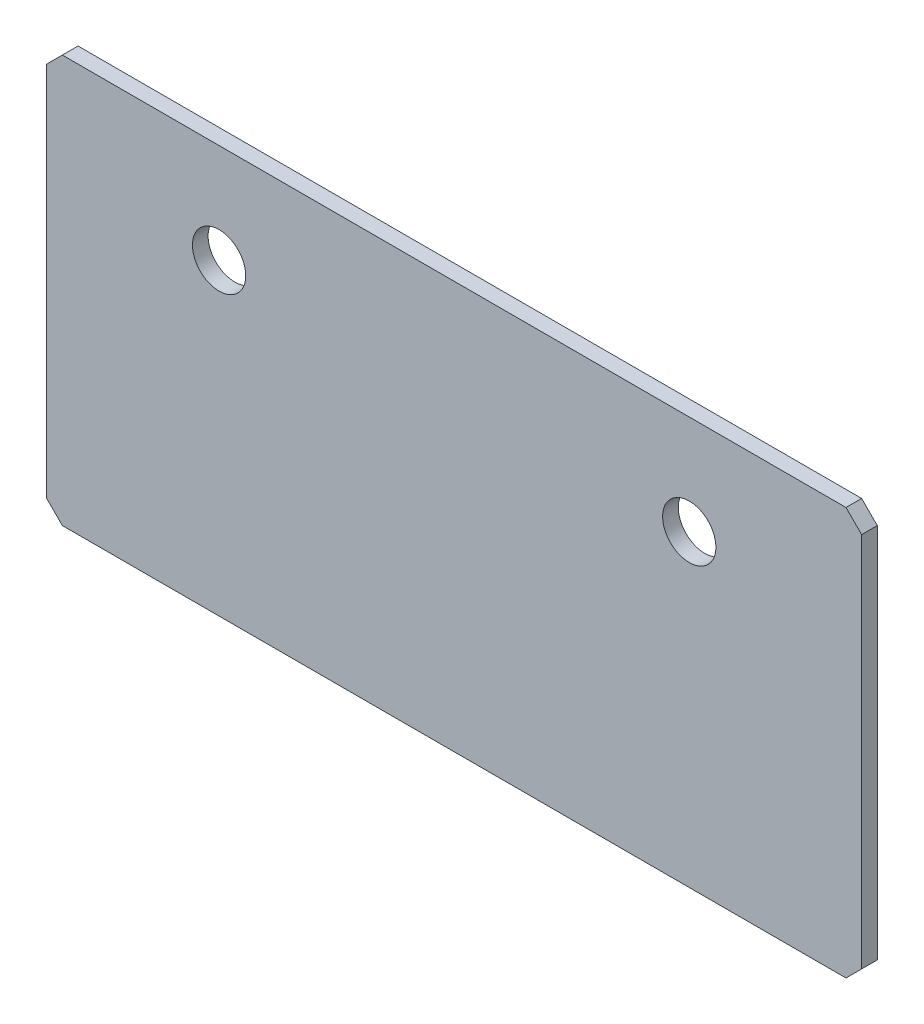
ISO-10303-21;
HEADER;
FILE_DESCRIPTION(('STEP AP214'),'2;1');
FILE_NAME('part.step','',(''),(''),'','','');
FILE_SCHEMA(('AUTOMOTIVE_DESIGN { 1 0 10303 214 1 1 1 1 }'));
ENDSEC;
DATA;
#1=APPLICATION_CONTEXT('core data for automotive mechanical design processes');
#2=APPLICATION_PROTOCOL_DEFINITION('international standard','automotive_design',2000,#1);
#3=PRODUCT_CONTEXT('',#1,'mechanical');
#4=PRODUCT('Part','Part','',(#3));
#5=PRODUCT_RELATED_PRODUCT_CATEGORY('part','',(#4));
#6=PRODUCT_DEFINITION_FORMATION('','',#4);
#7=PRODUCT_DEFINITION_CONTEXT('part definition',#1,'design');
#8=PRODUCT_DEFINITION('design','',#6,#7);
#9=PRODUCT_DEFINITION_SHAPE('','',#8);
#10=(LENGTH_UNIT() NAMED_UNIT(*) SI_UNIT(.MILLI.,.METRE.));
#11=(NAMED_UNIT(*) PLANE_ANGLE_UNIT() SI_UNIT($,.RADIAN.));
#12=(NAMED_UNIT(*) SI_UNIT($,.STERADIAN.) SOLID_ANGLE_UNIT());
#13=UNCERTAINTY_MEASURE_WITH_UNIT(LENGTH_MEASURE(1.E-05),#10,'distance_accuracy_value','');
#14=(GEOMETRIC_REPRESENTATION_CONTEXT(3) GLOBAL_UNCERTAINTY_ASSIGNED_CONTEXT((#13)) GLOBAL_UNIT_ASSIGNED_CONTEXT((#10,
#11,#12)) REPRESENTATION_CONTEXT('',''));
#15=CARTESIAN_POINT('',(0.,0.,0.));
#16=DIRECTION('',(0.,0.,1.));
#17=DIRECTION('',(1.,0.,0.));
#18=AXIS2_PLACEMENT_3D('',#15,#16,#17);
#19=CARTESIAN_POINT('',(0.,0.,1.));
#20=DIRECTION('',(0.,0.,1.));
#21=DIRECTION('',(1.,0.,0.));
#22=AXIS2_PLACEMENT_3D('',#19,#20,#21);
#23=PLANE('',#22);
#24=CARTESIAN_POINT('',(11.,-6.344,1.));
#25=DIRECTION('',(0.,0.,1.));
#26=DIRECTION('',(1.,0.,0.));
#27=AXIS2_PLACEMENT_3D('',#24,#25,#26);
#28=CIRCLE('',#27,1.7);
#29=CARTESIAN_POINT('',(12.7,-6.344,1.));
#30=VERTEX_POINT('',#29);
#31=EDGE_CURVE('E164',#30,#30,#28,.T.);
#32=ORIENTED_EDGE('',*,*,#31,.F.);
#33=EDGE_LOOP('',(#32));
#34=FACE_BOUND('',#33,.T.);
#35=DIRECTION('',(0.,1.,0.));
#36=VECTOR('',#35,1.);
#37=CARTESIAN_POINT('',(52.,0.,1.));
#38=LINE('',#37,#36);
#39=CARTESIAN_POINT('',(52.,-25.,1.));
#40=VERTEX_POINT('',#39);
#41=CARTESIAN_POINT('',(52.,-1.00000000000001,1.));
#42=VERTEX_POINT('',#41);
#43=EDGE_CURVE('E171',#40,#42,#38,.T.);
#44=ORIENTED_EDGE('',*,*,#43,.T.);
#45=DIRECTION('',(0.707106781186543,-0.707106781186552,0.));
#46=VECTOR('',#45,1.);
#47=CARTESIAN_POINT('',(25.5000000000004,25.5,1.));
#48=LINE('',#47,#46);
#49=CARTESIAN_POINT('',(51.,0.,1.));
#50=VERTEX_POINT('',#49);
#51=EDGE_CURVE('E148',#42,#50,#48,.F.);
#52=ORIENTED_EDGE('',*,*,#51,.T.);
#53=DIRECTION('',(-1.,0.,0.));
#54=VECTOR('',#53,1.);
#55=CARTESIAN_POINT('',(0.,0.,1.));
#56=LINE('',#55,#54);
#57=CARTESIAN_POINT('',(1.,0.,1.));
#58=VERTEX_POINT('',#57);
#59=EDGE_CURVE('E119',#50,#58,#56,.T.);
#60=ORIENTED_EDGE('',*,*,#59,.T.);
#61=DIRECTION('',(0.707106781186548,0.707106781186548,0.));
#62=VECTOR('',#61,1.);
#63=CARTESIAN_POINT('',(0.5,-0.5,1.));
#64=LINE('',#63,#62);
#65=CARTESIAN_POINT('',(0.,-1.,1.));
#66=VERTEX_POINT('',#65);
#67=EDGE_CURVE('E143',#58,#66,#64,.F.);
#68=ORIENTED_EDGE('',*,*,#67,.T.);
#69=DIRECTION('',(0.,-1.,0.));
#70=VECTOR('',#69,1.);
#71=CARTESIAN_POINT('',(0.,0.,1.));
#72=LINE('',#71,#70);
#73=CARTESIAN_POINT('',(0.,-25.,1.));
#74=VERTEX_POINT('',#73);
#75=EDGE_CURVE('E126',#66,#74,#72,.T.);
#76=ORIENTED_EDGE('',*,*,#75,.T.);
#77=DIRECTION('',(-0.707106781186548,0.707106781186548,0.));
#78=VECTOR('',#77,1.);
#79=CARTESIAN_POINT('',(-12.5,-12.5,1.));
#80=LINE('',#79,#78);
#81=CARTESIAN_POINT('',(1.,-26.,1.));
#82=VERTEX_POINT('',#81);
#83=EDGE_CURVE('E55',#74,#82,#80,.F.);
#84=ORIENTED_EDGE('',*,*,#83,.T.);
#85=DIRECTION('',(1.,0.,0.));
#86=VECTOR('',#85,1.);
#87=CARTESIAN_POINT('',(0.,-26.,1.));
#88=LINE('',#87,#86);
#89=CARTESIAN_POINT('',(51.,-26.,1.));
#90=VERTEX_POINT('',#89);
#91=EDGE_CURVE('E129',#82,#90,#88,.T.);
#92=ORIENTED_EDGE('',*,*,#91,.T.);
#93=DIRECTION('',(-0.70710678118655,-0.707106781186545,0.));
#94=VECTOR('',#93,1.);
#95=CARTESIAN_POINT('',(38.4999999999998,-38.5000000000001,1.));
#96=LINE('',#95,#94);
#97=EDGE_CURVE('E146',#90,#40,#96,.F.);
#98=ORIENTED_EDGE('',*,*,#97,.T.);
#99=EDGE_LOOP('',(#44,#52,#60,#68,#76,#84,#92,#98));
#100=FACE_BOUND('',#99,.T.);
#101=CARTESIAN_POINT('',(41.,-6.344,1.));
#102=DIRECTION('',(0.,0.,1.));
#103=DIRECTION('',(1.,0.,0.));
#104=AXIS2_PLACEMENT_3D('',#101,#102,#103);
#105=CIRCLE('',#104,1.7);
#106=CARTESIAN_POINT('',(42.7,-6.344,1.));
#107=VERTEX_POINT('',#106);
#108=EDGE_CURVE('E176',#107,#107,#105,.T.);
#109=ORIENTED_EDGE('',*,*,#108,.F.);
#110=EDGE_LOOP('',(#109));
#111=FACE_BOUND('',#110,.T.);
#112=ADVANCED_FACE('F33',(#34,#100,#111),#23,.T.);
#113=CARTESIAN_POINT('',(0.,0.,0.));
#114=DIRECTION('',(0.,0.,1.));
#115=DIRECTION('',(1.,0.,0.));
#116=AXIS2_PLACEMENT_3D('',#113,#114,#115);
#117=PLANE('',#116);
#118=DIRECTION('',(-1.,0.,0.));
#119=VECTOR('',#118,1.);
#120=CARTESIAN_POINT('',(0.,0.,0.));
#121=LINE('',#120,#119);
#122=CARTESIAN_POINT('',(51.,0.,0.));
#123=VERTEX_POINT('',#122);
#124=CARTESIAN_POINT('',(1.,0.,0.));
#125=VERTEX_POINT('',#124);
#126=EDGE_CURVE('E116',#123,#125,#121,.T.);
#127=ORIENTED_EDGE('',*,*,#126,.F.);
#128=DIRECTION('',(-0.707106781186543,0.707106781186552,0.));
#129=VECTOR('',#128,1.);
#130=CARTESIAN_POINT('',(51.,0.,0.));
#131=LINE('',#130,#129);
#132=CARTESIAN_POINT('',(52.,-1.00000000000001,0.));
#133=VERTEX_POINT('',#132);
#134=EDGE_CURVE('E99',#123,#133,#131,.F.);
#135=ORIENTED_EDGE('',*,*,#134,.T.);
#136=DIRECTION('',(0.,1.,0.));
#137=VECTOR('',#136,1.);
#138=CARTESIAN_POINT('',(52.,0.,0.));
#139=LINE('',#138,#137);
#140=CARTESIAN_POINT('',(52.,-25.,0.));
#141=VERTEX_POINT('',#140);
#142=EDGE_CURVE('E127',#141,#133,#139,.T.);
#143=ORIENTED_EDGE('',*,*,#142,.F.);
#144=DIRECTION('',(0.70710678118655,0.707106781186545,0.));
#145=VECTOR('',#144,1.);
#146=CARTESIAN_POINT('',(52.,-25.,0.));
#147=LINE('',#146,#145);
#148=CARTESIAN_POINT('',(51.,-26.,0.));
#149=VERTEX_POINT('',#148);
#150=EDGE_CURVE('E110',#141,#149,#147,.F.);
#151=ORIENTED_EDGE('',*,*,#150,.T.);
#152=DIRECTION('',(1.,0.,0.));
#153=VECTOR('',#152,1.);
#154=CARTESIAN_POINT('',(0.,-26.,0.));
#155=LINE('',#154,#153);
#156=CARTESIAN_POINT('',(1.,-26.,0.));
#157=VERTEX_POINT('',#156);
#158=EDGE_CURVE('E131',#157,#149,#155,.T.);
#159=ORIENTED_EDGE('',*,*,#158,.F.);
#160=DIRECTION('',(0.707106781186548,-0.707106781186548,0.));
#161=VECTOR('',#160,1.);
#162=CARTESIAN_POINT('',(1.,-26.,0.));
#163=LINE('',#162,#161);
#164=CARTESIAN_POINT('',(0.,-25.,0.));
#165=VERTEX_POINT('',#164);
#166=EDGE_CURVE('E137',#157,#165,#163,.F.);
#167=ORIENTED_EDGE('',*,*,#166,.T.);
#168=DIRECTION('',(0.,-1.,0.));
#169=VECTOR('',#168,1.);
#170=CARTESIAN_POINT('',(0.,0.,0.));
#171=LINE('',#170,#169);
#172=CARTESIAN_POINT('',(0.,-1.,0.));
#173=VERTEX_POINT('',#172);
#174=EDGE_CURVE('E159',#173,#165,#171,.T.);
#175=ORIENTED_EDGE('',*,*,#174,.F.);
#176=DIRECTION('',(-0.707106781186548,-0.707106781186548,0.));
#177=VECTOR('',#176,1.);
#178=CARTESIAN_POINT('',(0.,-1.,0.));
#179=LINE('',#178,#177);
#180=EDGE_CURVE('E120',#173,#125,#179,.F.);
#181=ORIENTED_EDGE('',*,*,#180,.T.);
#182=EDGE_LOOP('',(#127,#135,#143,#151,#159,#167,#175,#181));
#183=FACE_BOUND('',#182,.T.);
#184=CARTESIAN_POINT('',(11.,-6.344,0.));
#185=DIRECTION('',(0.,0.,1.));
#186=DIRECTION('',(1.,0.,0.));
#187=AXIS2_PLACEMENT_3D('',#184,#185,#186);
#188=CIRCLE('',#187,1.7);
#189=CARTESIAN_POINT('',(12.7,-6.344,0.));
#190=VERTEX_POINT('',#189);
#191=EDGE_CURVE('E167',#190,#190,#188,.T.);
#192=ORIENTED_EDGE('',*,*,#191,.T.);
#193=EDGE_LOOP('',(#192));
#194=FACE_BOUND('',#193,.T.);
#195=CARTESIAN_POINT('',(41.,-6.344,0.));
#196=DIRECTION('',(0.,0.,1.));
#197=DIRECTION('',(1.,0.,0.));
#198=AXIS2_PLACEMENT_3D('',#195,#196,#197);
#199=CIRCLE('',#198,1.7);
#200=CARTESIAN_POINT('',(42.7,-6.344,0.));
#201=VERTEX_POINT('',#200);
#202=EDGE_CURVE('E178',#201,#201,#199,.T.);
#203=ORIENTED_EDGE('',*,*,#202,.T.);
#204=EDGE_LOOP('',(#203));
#205=FACE_BOUND('',#204,.T.);
#206=ADVANCED_FACE('F123',(#183,#194,#205),#117,.F.);
#207=CARTESIAN_POINT('',(0.,0.,1.));
#208=DIRECTION('',(1.,0.,0.));
#209=DIRECTION('',(0.,1.,0.));
#210=AXIS2_PLACEMENT_3D('',#207,#208,#209);
#211=PLANE('',#210);
#212=ORIENTED_EDGE('',*,*,#174,.T.);
#213=DIRECTION('',(0.,0.,1.));
#214=VECTOR('',#213,1.);
#215=CARTESIAN_POINT('',(0.,-25.,1.));
#216=LINE('',#215,#214);
#217=EDGE_CURVE('E11',#165,#74,#216,.T.);
#218=ORIENTED_EDGE('',*,*,#217,.T.);
#219=ORIENTED_EDGE('',*,*,#75,.F.);
#220=DIRECTION('',(0.,0.,-1.));
#221=VECTOR('',#220,1.);
#222=CARTESIAN_POINT('',(0.,-1.,1.));
#223=LINE('',#222,#221);
#224=EDGE_CURVE('E41',#66,#173,#223,.T.);
#225=ORIENTED_EDGE('',*,*,#224,.T.);
#226=EDGE_LOOP('',(#212,#218,#219,#225));
#227=FACE_BOUND('',#226,.T.);
#228=ADVANCED_FACE('F158',(#227),#211,.F.);
#229=CARTESIAN_POINT('',(0.,-26.,1.));
#230=DIRECTION('',(0.,1.,0.));
#231=DIRECTION('',(0.,0.,1.));
#232=AXIS2_PLACEMENT_3D('',#229,#230,#231);
#233=PLANE('',#232);
#234=ORIENTED_EDGE('',*,*,#158,.T.);
#235=DIRECTION('',(0.,0.,1.));
#236=VECTOR('',#235,1.);
#237=CARTESIAN_POINT('',(51.,-26.,1.));
#238=LINE('',#237,#236);
#239=EDGE_CURVE('E48',#149,#90,#238,.T.);
#240=ORIENTED_EDGE('',*,*,#239,.T.);
#241=ORIENTED_EDGE('',*,*,#91,.F.);
#242=DIRECTION('',(0.,0.,-1.));
#243=VECTOR('',#242,1.);
#244=CARTESIAN_POINT('',(1.,-26.,1.));
#245=LINE('',#244,#243);
#246=EDGE_CURVE('E150',#82,#157,#245,.T.);
#247=ORIENTED_EDGE('',*,*,#246,.T.);
#248=EDGE_LOOP('',(#234,#240,#241,#247));
#249=FACE_BOUND('',#248,.T.);
#250=ADVANCED_FACE('F204',(#249),#233,.F.);
#251=CARTESIAN_POINT('',(52.,0.,1.));
#252=DIRECTION('',(-1.,0.,0.));
#253=DIRECTION('',(0.,0.,1.));
#254=AXIS2_PLACEMENT_3D('',#251,#252,#253);
#255=PLANE('',#254);
#256=ORIENTED_EDGE('',*,*,#142,.T.);
#257=DIRECTION('',(0.,0.,1.));
#258=VECTOR('',#257,1.);
#259=CARTESIAN_POINT('',(52.,-1.00000000000001,1.));
#260=LINE('',#259,#258);
#261=EDGE_CURVE('E104',#133,#42,#260,.T.);
#262=ORIENTED_EDGE('',*,*,#261,.T.);
#263=ORIENTED_EDGE('',*,*,#43,.F.);
#264=DIRECTION('',(0.,0.,-1.));
#265=VECTOR('',#264,1.);
#266=CARTESIAN_POINT('',(52.,-25.,1.));
#267=LINE('',#266,#265);
#268=EDGE_CURVE('E109',#40,#141,#267,.T.);
#269=ORIENTED_EDGE('',*,*,#268,.T.);
#270=EDGE_LOOP('',(#256,#262,#263,#269));
#271=FACE_BOUND('',#270,.T.);
#272=ADVANCED_FACE('F201',(#271),#255,.F.);
#273=CARTESIAN_POINT('',(0.,0.,1.));
#274=DIRECTION('',(0.,-1.,0.));
#275=DIRECTION('',(0.,0.,-1.));
#276=AXIS2_PLACEMENT_3D('',#273,#274,#275);
#277=PLANE('',#276);
#278=ORIENTED_EDGE('',*,*,#59,.F.);
#279=DIRECTION('',(0.,0.,-1.));
#280=VECTOR('',#279,1.);
#281=CARTESIAN_POINT('',(51.,0.,1.));
#282=LINE('',#281,#280);
#283=EDGE_CURVE('E103',#50,#123,#282,.T.);
#284=ORIENTED_EDGE('',*,*,#283,.T.);
#285=ORIENTED_EDGE('',*,*,#126,.T.);
#286=DIRECTION('',(0.,0.,1.));
#287=VECTOR('',#286,1.);
#288=CARTESIAN_POINT('',(1.,0.,1.));
#289=LINE('',#288,#287);
#290=EDGE_CURVE('E121',#125,#58,#289,.T.);
#291=ORIENTED_EDGE('',*,*,#290,.T.);
#292=EDGE_LOOP('',(#278,#284,#285,#291));
#293=FACE_BOUND('',#292,.T.);
#294=ADVANCED_FACE('F115',(#293),#277,.F.);
#295=CARTESIAN_POINT('',(11.,-6.344,1.));
#296=DIRECTION('',(0.,0.,-1.));
#297=DIRECTION('',(-1.,0.,0.));
#298=AXIS2_PLACEMENT_3D('',#295,#296,#297);
#299=CYLINDRICAL_SURFACE('',#298,1.7);
#300=ORIENTED_EDGE('',*,*,#31,.T.);
#301=EDGE_LOOP('',(#300));
#302=FACE_BOUND('',#301,.T.);
#303=ORIENTED_EDGE('',*,*,#191,.F.);
#304=EDGE_LOOP('',(#303));
#305=FACE_BOUND('',#304,.T.);
#306=ADVANCED_FACE('F196',(#302,#305),#299,.F.);
#307=CARTESIAN_POINT('',(41.,-6.344,1.));
#308=DIRECTION('',(0.,0.,-1.));
#309=DIRECTION('',(-1.,0.,0.));
#310=AXIS2_PLACEMENT_3D('',#307,#308,#309);
#311=CYLINDRICAL_SURFACE('',#310,1.7);
#312=ORIENTED_EDGE('',*,*,#108,.T.);
#313=EDGE_LOOP('',(#312));
#314=FACE_BOUND('',#313,.T.);
#315=ORIENTED_EDGE('',*,*,#202,.F.);
#316=EDGE_LOOP('',(#315));
#317=FACE_BOUND('',#316,.T.);
#318=ADVANCED_FACE('F184',(#314,#317),#311,.F.);
#319=CARTESIAN_POINT('',(51.,0.,1.));
#320=DIRECTION('',(-0.707106781186552,-0.707106781186543,0.));
#321=DIRECTION('',(0.,0.,-1.));
#322=AXIS2_PLACEMENT_3D('',#319,#320,#321);
#323=PLANE('',#322);
#324=ORIENTED_EDGE('',*,*,#51,.F.);
#325=ORIENTED_EDGE('',*,*,#261,.F.);
#326=ORIENTED_EDGE('',*,*,#134,.F.);
#327=ORIENTED_EDGE('',*,*,#283,.F.);
#328=EDGE_LOOP('',(#324,#325,#326,#327));
#329=FACE_BOUND('',#328,.T.);
#330=ADVANCED_FACE('F102',(#329),#323,.F.);
#331=CARTESIAN_POINT('',(52.,-25.,1.));
#332=DIRECTION('',(-0.707106781186545,0.70710678118655,0.));
#333=DIRECTION('',(0.,0.,-1.));
#334=AXIS2_PLACEMENT_3D('',#331,#332,#333);
#335=PLANE('',#334);
#336=ORIENTED_EDGE('',*,*,#97,.F.);
#337=ORIENTED_EDGE('',*,*,#239,.F.);
#338=ORIENTED_EDGE('',*,*,#150,.F.);
#339=ORIENTED_EDGE('',*,*,#268,.F.);
#340=EDGE_LOOP('',(#336,#337,#338,#339));
#341=FACE_BOUND('',#340,.T.);
#342=ADVANCED_FACE('F212',(#341),#335,.F.);
#343=CARTESIAN_POINT('',(1.,-26.,1.));
#344=DIRECTION('',(0.707106781186547,0.707106781186547,0.));
#345=DIRECTION('',(0.,0.,-1.));
#346=AXIS2_PLACEMENT_3D('',#343,#344,#345);
#347=PLANE('',#346);
#348=ORIENTED_EDGE('',*,*,#83,.F.);
#349=ORIENTED_EDGE('',*,*,#217,.F.);
#350=ORIENTED_EDGE('',*,*,#166,.F.);
#351=ORIENTED_EDGE('',*,*,#246,.F.);
#352=EDGE_LOOP('',(#348,#349,#350,#351));
#353=FACE_BOUND('',#352,.T.);
#354=ADVANCED_FACE('F214',(#353),#347,.F.);
#355=CARTESIAN_POINT('',(0.,-1.,1.));
#356=DIRECTION('',(0.707106781186547,-0.707106781186547,0.));
#357=DIRECTION('',(0.,0.,-1.));
#358=AXIS2_PLACEMENT_3D('',#355,#356,#357);
#359=PLANE('',#358);
#360=ORIENTED_EDGE('',*,*,#67,.F.);
#361=ORIENTED_EDGE('',*,*,#290,.F.);
#362=ORIENTED_EDGE('',*,*,#180,.F.);
#363=ORIENTED_EDGE('',*,*,#224,.F.);
#364=EDGE_LOOP('',(#360,#361,#362,#363));
#365=FACE_BOUND('',#364,.T.);
#366=ADVANCED_FACE('F35',(#365),#359,.F.);
#367=CLOSED_SHELL('',(#112,#206,#228,#250,#272,#294,#306,#318,#330,#342,#354,#366));
#368=MANIFOLD_SOLID_BREP('B2',#367);
#369=ADVANCED_BREP_SHAPE_REPRESENTATION('',(#18,#368),#14);
#370=SHAPE_DEFINITION_REPRESENTATION(#9,#369);
ENDSEC;
END-ISO-10303-21;
